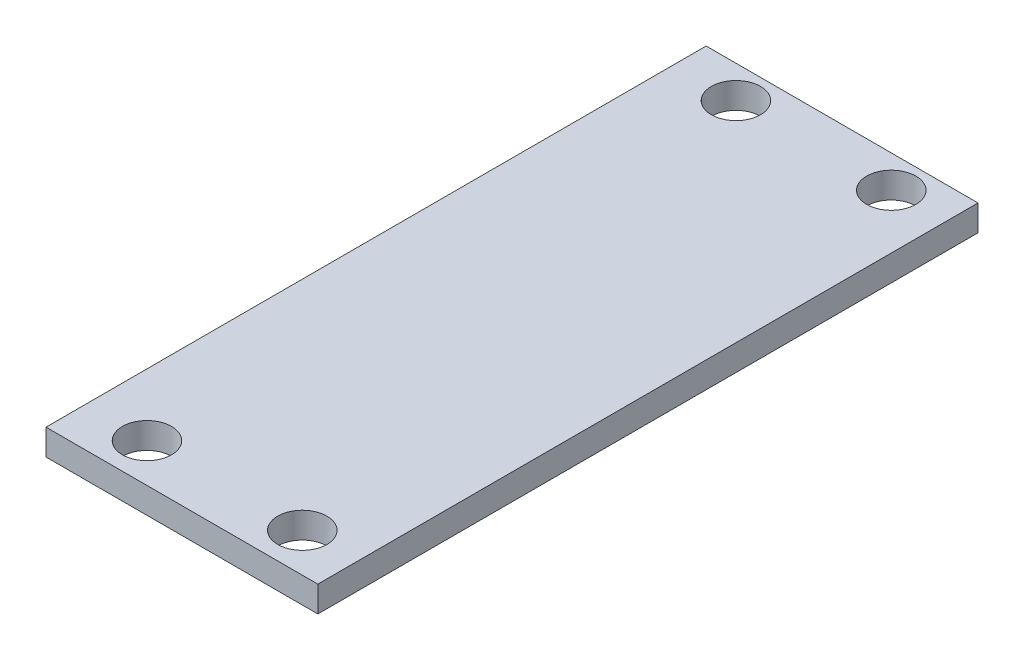
ISO-10303-21;
HEADER;
FILE_DESCRIPTION(('STEP AP214'),'2;1');
FILE_NAME('part.step','',(''),(''),'','','');
FILE_SCHEMA(('AUTOMOTIVE_DESIGN { 1 0 10303 214 1 1 1 1 }'));
ENDSEC;
DATA;
#1=APPLICATION_CONTEXT('core data for automotive mechanical design processes');
#2=APPLICATION_PROTOCOL_DEFINITION('international standard','automotive_design',2000,#1);
#3=PRODUCT_CONTEXT('',#1,'mechanical');
#4=PRODUCT('Part','Part','',(#3));
#5=PRODUCT_RELATED_PRODUCT_CATEGORY('part','',(#4));
#6=PRODUCT_DEFINITION_FORMATION('','',#4);
#7=PRODUCT_DEFINITION_CONTEXT('part definition',#1,'design');
#8=PRODUCT_DEFINITION('design','',#6,#7);
#9=PRODUCT_DEFINITION_SHAPE('','',#8);
#10=(LENGTH_UNIT() NAMED_UNIT(*) SI_UNIT(.MILLI.,.METRE.));
#11=(NAMED_UNIT(*) PLANE_ANGLE_UNIT() SI_UNIT($,.RADIAN.));
#12=(NAMED_UNIT(*) SI_UNIT($,.STERADIAN.) SOLID_ANGLE_UNIT());
#13=UNCERTAINTY_MEASURE_WITH_UNIT(LENGTH_MEASURE(1.E-05),#10,'distance_accuracy_value','');
#14=(GEOMETRIC_REPRESENTATION_CONTEXT(3) GLOBAL_UNCERTAINTY_ASSIGNED_CONTEXT((#13)) GLOBAL_UNIT_ASSIGNED_CONTEXT((#10,
#11,#12)) REPRESENTATION_CONTEXT('',''));
#15=CARTESIAN_POINT('',(0.,0.,0.));
#16=DIRECTION('',(0.,0.,1.));
#17=DIRECTION('',(1.,0.,0.));
#18=AXIS2_PLACEMENT_3D('',#15,#16,#17);
#19=CARTESIAN_POINT('',(0.,2.,0.));
#20=DIRECTION('',(0.,1.,0.));
#21=DIRECTION('',(0.,0.,1.));
#22=AXIS2_PLACEMENT_3D('',#19,#20,#21);
#23=PLANE('',#22);
#24=CARTESIAN_POINT('',(2.35497925311251,2.,34.9813278008299));
#25=DIRECTION('',(0.,1.,0.));
#26=DIRECTION('',(0.,0.,1.));
#27=AXIS2_PLACEMENT_3D('',#24,#25,#26);
#28=CIRCLE('',#27,1.9);
#29=CARTESIAN_POINT('',(2.35497925311251,2.,36.8813278008299));
#30=VERTEX_POINT('',#29);
#31=EDGE_CURVE('E124',#30,#30,#28,.T.);
#32=ORIENTED_EDGE('',*,*,#31,.F.);
#33=EDGE_LOOP('',(#32));
#34=FACE_BOUND('',#33,.T.);
#35=CARTESIAN_POINT('',(-9.64502074688796,2.,-10.5186721991701));
#36=DIRECTION('',(0.,1.,0.));
#37=DIRECTION('',(0.,0.,1.));
#38=AXIS2_PLACEMENT_3D('',#35,#36,#37);
#39=CIRCLE('',#38,1.9);
#40=CARTESIAN_POINT('',(-9.64502074688796,2.,-8.61867219917012));
#41=VERTEX_POINT('',#40);
#42=EDGE_CURVE('E103',#41,#41,#39,.T.);
#43=ORIENTED_EDGE('',*,*,#42,.F.);
#44=EDGE_LOOP('',(#43));
#45=FACE_BOUND('',#44,.T.);
#46=DIRECTION('',(0.,0.,1.));
#47=VECTOR('',#46,1.);
#48=CARTESIAN_POINT('',(-14.445020746888,2.,-13.0186721991701));
#49=LINE('',#48,#47);
#50=CARTESIAN_POINT('',(-14.445020746888,2.,-13.0186721991701));
#51=VERTEX_POINT('',#50);
#52=CARTESIAN_POINT('',(-14.445020746888,2.,37.9813278008299));
#53=VERTEX_POINT('',#52);
#54=EDGE_CURVE('E88',#51,#53,#49,.T.);
#55=ORIENTED_EDGE('',*,*,#54,.T.);
#56=DIRECTION('',(1.,0.,0.));
#57=VECTOR('',#56,1.);
#58=CARTESIAN_POINT('',(-14.445020746888,2.,37.9813278008299));
#59=LINE('',#58,#57);
#60=CARTESIAN_POINT('',(6.55497925311204,2.,37.9813278008299));
#61=VERTEX_POINT('',#60);
#62=EDGE_CURVE('E83',#53,#61,#59,.T.);
#63=ORIENTED_EDGE('',*,*,#62,.T.);
#64=DIRECTION('',(0.,0.,-1.));
#65=VECTOR('',#64,1.);
#66=CARTESIAN_POINT('',(6.55497925311204,2.,-13.0186721991701));
#67=LINE('',#66,#65);
#68=CARTESIAN_POINT('',(6.55497925311204,2.,-13.0186721991701));
#69=VERTEX_POINT('',#68);
#70=EDGE_CURVE('E86',#61,#69,#67,.T.);
#71=ORIENTED_EDGE('',*,*,#70,.T.);
#72=DIRECTION('',(-1.,0.,0.));
#73=VECTOR('',#72,1.);
#74=CARTESIAN_POINT('',(-14.445020746888,2.,-13.0186721991701));
#75=LINE('',#74,#73);
#76=EDGE_CURVE('E53',#69,#51,#75,.T.);
#77=ORIENTED_EDGE('',*,*,#76,.T.);
#78=EDGE_LOOP('',(#55,#63,#71,#77));
#79=FACE_BOUND('',#78,.T.);
#80=CARTESIAN_POINT('',(2.35497925311204,2.,-10.5186721991701));
#81=DIRECTION('',(0.,1.,0.));
#82=DIRECTION('',(0.,0.,1.));
#83=AXIS2_PLACEMENT_3D('',#80,#81,#82);
#84=CIRCLE('',#83,1.9);
#85=CARTESIAN_POINT('',(2.35497925311204,2.,-8.61867219917012));
#86=VERTEX_POINT('',#85);
#87=EDGE_CURVE('E118',#86,#86,#84,.T.);
#88=ORIENTED_EDGE('',*,*,#87,.F.);
#89=EDGE_LOOP('',(#88));
#90=FACE_BOUND('',#89,.T.);
#91=CARTESIAN_POINT('',(-9.64502074688749,2.,34.9813278008299));
#92=DIRECTION('',(0.,1.,0.));
#93=DIRECTION('',(0.,0.,1.));
#94=AXIS2_PLACEMENT_3D('',#91,#92,#93);
#95=CIRCLE('',#94,1.9);
#96=CARTESIAN_POINT('',(-9.64502074688749,2.,36.8813278008299));
#97=VERTEX_POINT('',#96);
#98=EDGE_CURVE('E130',#97,#97,#95,.T.);
#99=ORIENTED_EDGE('',*,*,#98,.F.);
#100=EDGE_LOOP('',(#99));
#101=FACE_BOUND('',#100,.T.);
#102=ADVANCED_FACE('F36',(#34,#45,#79,#90,#101),#23,.T.);
#103=CARTESIAN_POINT('',(0.,0.,0.));
#104=DIRECTION('',(0.,1.,0.));
#105=DIRECTION('',(0.,0.,1.));
#106=AXIS2_PLACEMENT_3D('',#103,#104,#105);
#107=PLANE('',#106);
#108=DIRECTION('',(0.,0.,1.));
#109=VECTOR('',#108,1.);
#110=CARTESIAN_POINT('',(-14.445020746888,0.,-13.0186721991701));
#111=LINE('',#110,#109);
#112=CARTESIAN_POINT('',(-14.445020746888,0.,-13.0186721991701));
#113=VERTEX_POINT('',#112);
#114=CARTESIAN_POINT('',(-14.445020746888,0.,37.9813278008299));
#115=VERTEX_POINT('',#114);
#116=EDGE_CURVE('E100',#113,#115,#111,.T.);
#117=ORIENTED_EDGE('',*,*,#116,.F.);
#118=DIRECTION('',(-1.,0.,0.));
#119=VECTOR('',#118,1.);
#120=CARTESIAN_POINT('',(-14.445020746888,0.,-13.0186721991701));
#121=LINE('',#120,#119);
#122=CARTESIAN_POINT('',(6.55497925311204,0.,-13.0186721991701));
#123=VERTEX_POINT('',#122);
#124=EDGE_CURVE('E76',#123,#113,#121,.T.);
#125=ORIENTED_EDGE('',*,*,#124,.F.);
#126=DIRECTION('',(0.,0.,-1.));
#127=VECTOR('',#126,1.);
#128=CARTESIAN_POINT('',(6.55497925311204,0.,-13.0186721991701));
#129=LINE('',#128,#127);
#130=CARTESIAN_POINT('',(6.55497925311204,0.,37.9813278008299));
#131=VERTEX_POINT('',#130);
#132=EDGE_CURVE('E70',#131,#123,#129,.T.);
#133=ORIENTED_EDGE('',*,*,#132,.F.);
#134=DIRECTION('',(1.,0.,0.));
#135=VECTOR('',#134,1.);
#136=CARTESIAN_POINT('',(-14.445020746888,0.,37.9813278008299));
#137=LINE('',#136,#135);
#138=EDGE_CURVE('E92',#115,#131,#137,.T.);
#139=ORIENTED_EDGE('',*,*,#138,.F.);
#140=EDGE_LOOP('',(#117,#125,#133,#139));
#141=FACE_BOUND('',#140,.T.);
#142=CARTESIAN_POINT('',(-9.64502074688796,0.,-10.5186721991701));
#143=DIRECTION('',(0.,1.,0.));
#144=DIRECTION('',(0.,0.,1.));
#145=AXIS2_PLACEMENT_3D('',#142,#143,#144);
#146=CIRCLE('',#145,1.9);
#147=CARTESIAN_POINT('',(-9.64502074688796,0.,-8.61867219917012));
#148=VERTEX_POINT('',#147);
#149=EDGE_CURVE('E115',#148,#148,#146,.T.);
#150=ORIENTED_EDGE('',*,*,#149,.T.);
#151=EDGE_LOOP('',(#150));
#152=FACE_BOUND('',#151,.T.);
#153=CARTESIAN_POINT('',(2.35497925311204,0.,-10.5186721991701));
#154=DIRECTION('',(0.,1.,0.));
#155=DIRECTION('',(0.,0.,1.));
#156=AXIS2_PLACEMENT_3D('',#153,#154,#155);
#157=CIRCLE('',#156,1.9);
#158=CARTESIAN_POINT('',(2.35497925311204,0.,-8.61867219917012));
#159=VERTEX_POINT('',#158);
#160=EDGE_CURVE('E121',#159,#159,#157,.T.);
#161=ORIENTED_EDGE('',*,*,#160,.T.);
#162=EDGE_LOOP('',(#161));
#163=FACE_BOUND('',#162,.T.);
#164=CARTESIAN_POINT('',(2.35497925311251,0.,34.9813278008299));
#165=DIRECTION('',(0.,1.,0.));
#166=DIRECTION('',(0.,0.,1.));
#167=AXIS2_PLACEMENT_3D('',#164,#165,#166);
#168=CIRCLE('',#167,1.9);
#169=CARTESIAN_POINT('',(2.35497925311251,0.,36.8813278008299));
#170=VERTEX_POINT('',#169);
#171=EDGE_CURVE('E127',#170,#170,#168,.T.);
#172=ORIENTED_EDGE('',*,*,#171,.T.);
#173=EDGE_LOOP('',(#172));
#174=FACE_BOUND('',#173,.T.);
#175=CARTESIAN_POINT('',(-9.64502074688749,0.,34.9813278008299));
#176=DIRECTION('',(0.,1.,0.));
#177=DIRECTION('',(0.,0.,1.));
#178=AXIS2_PLACEMENT_3D('',#175,#176,#177);
#179=CIRCLE('',#178,1.9);
#180=CARTESIAN_POINT('',(-9.64502074688749,0.,36.8813278008299));
#181=VERTEX_POINT('',#180);
#182=EDGE_CURVE('E133',#181,#181,#179,.T.);
#183=ORIENTED_EDGE('',*,*,#182,.T.);
#184=EDGE_LOOP('',(#183));
#185=FACE_BOUND('',#184,.T.);
#186=ADVANCED_FACE('F111',(#141,#152,#163,#174,#185),#107,.F.);
#187=CARTESIAN_POINT('',(-14.445020746888,2.,-13.0186721991701));
#188=DIRECTION('',(1.,0.,0.));
#189=DIRECTION('',(0.,0.,-1.));
#190=AXIS2_PLACEMENT_3D('',#187,#188,#189);
#191=PLANE('',#190);
#192=ORIENTED_EDGE('',*,*,#116,.T.);
#193=DIRECTION('',(0.,-1.,0.));
#194=VECTOR('',#193,1.);
#195=CARTESIAN_POINT('',(-14.445020746888,2.,37.9813278008299));
#196=LINE('',#195,#194);
#197=EDGE_CURVE('E11',#53,#115,#196,.T.);
#198=ORIENTED_EDGE('',*,*,#197,.F.);
#199=ORIENTED_EDGE('',*,*,#54,.F.);
#200=DIRECTION('',(0.,-1.,0.));
#201=VECTOR('',#200,1.);
#202=CARTESIAN_POINT('',(-14.445020746888,2.,-13.0186721991701));
#203=LINE('',#202,#201);
#204=EDGE_CURVE('E96',#51,#113,#203,.T.);
#205=ORIENTED_EDGE('',*,*,#204,.T.);
#206=EDGE_LOOP('',(#192,#198,#199,#205));
#207=FACE_BOUND('',#206,.T.);
#208=ADVANCED_FACE('F38',(#207),#191,.F.);
#209=CARTESIAN_POINT('',(-14.445020746888,2.,37.9813278008299));
#210=DIRECTION('',(0.,0.,-1.));
#211=DIRECTION('',(-1.,0.,0.));
#212=AXIS2_PLACEMENT_3D('',#209,#210,#211);
#213=PLANE('',#212);
#214=ORIENTED_EDGE('',*,*,#138,.T.);
#215=DIRECTION('',(0.,-1.,0.));
#216=VECTOR('',#215,1.);
#217=CARTESIAN_POINT('',(6.55497925311204,2.,37.9813278008299));
#218=LINE('',#217,#216);
#219=EDGE_CURVE('E45',#61,#131,#218,.T.);
#220=ORIENTED_EDGE('',*,*,#219,.F.);
#221=ORIENTED_EDGE('',*,*,#62,.F.);
#222=ORIENTED_EDGE('',*,*,#197,.T.);
#223=EDGE_LOOP('',(#214,#220,#221,#222));
#224=FACE_BOUND('',#223,.T.);
#225=ADVANCED_FACE('F91',(#224),#213,.F.);
#226=CARTESIAN_POINT('',(6.55497925311204,2.,-13.0186721991701));
#227=DIRECTION('',(-1.,0.,0.));
#228=DIRECTION('',(0.,0.,1.));
#229=AXIS2_PLACEMENT_3D('',#226,#227,#228);
#230=PLANE('',#229);
#231=ORIENTED_EDGE('',*,*,#132,.T.);
#232=DIRECTION('',(0.,-1.,0.));
#233=VECTOR('',#232,1.);
#234=CARTESIAN_POINT('',(6.55497925311204,2.,-13.0186721991701));
#235=LINE('',#234,#233);
#236=EDGE_CURVE('E93',#69,#123,#235,.T.);
#237=ORIENTED_EDGE('',*,*,#236,.F.);
#238=ORIENTED_EDGE('',*,*,#70,.F.);
#239=ORIENTED_EDGE('',*,*,#219,.T.);
#240=EDGE_LOOP('',(#231,#237,#238,#239));
#241=FACE_BOUND('',#240,.T.);
#242=ADVANCED_FACE('F94',(#241),#230,.F.);
#243=CARTESIAN_POINT('',(-14.445020746888,2.,-13.0186721991701));
#244=DIRECTION('',(0.,0.,1.));
#245=DIRECTION('',(1.,0.,0.));
#246=AXIS2_PLACEMENT_3D('',#243,#244,#245);
#247=PLANE('',#246);
#248=ORIENTED_EDGE('',*,*,#124,.T.);
#249=ORIENTED_EDGE('',*,*,#204,.F.);
#250=ORIENTED_EDGE('',*,*,#76,.F.);
#251=ORIENTED_EDGE('',*,*,#236,.T.);
#252=EDGE_LOOP('',(#248,#249,#250,#251));
#253=FACE_BOUND('',#252,.T.);
#254=ADVANCED_FACE('F108',(#253),#247,.F.);
#255=CARTESIAN_POINT('',(-9.64502074688796,2.,-10.5186721991701));
#256=DIRECTION('',(0.,-1.,0.));
#257=DIRECTION('',(0.,0.,-1.));
#258=AXIS2_PLACEMENT_3D('',#255,#256,#257);
#259=CYLINDRICAL_SURFACE('',#258,1.9);
#260=ORIENTED_EDGE('',*,*,#42,.T.);
#261=EDGE_LOOP('',(#260));
#262=FACE_BOUND('',#261,.T.);
#263=ORIENTED_EDGE('',*,*,#149,.F.);
#264=EDGE_LOOP('',(#263));
#265=FACE_BOUND('',#264,.T.);
#266=ADVANCED_FACE('F152',(#262,#265),#259,.F.);
#267=CARTESIAN_POINT('',(2.35497925311204,2.,-10.5186721991701));
#268=DIRECTION('',(0.,-1.,0.));
#269=DIRECTION('',(0.,0.,-1.));
#270=AXIS2_PLACEMENT_3D('',#267,#268,#269);
#271=CYLINDRICAL_SURFACE('',#270,1.9);
#272=ORIENTED_EDGE('',*,*,#87,.T.);
#273=EDGE_LOOP('',(#272));
#274=FACE_BOUND('',#273,.T.);
#275=ORIENTED_EDGE('',*,*,#160,.F.);
#276=EDGE_LOOP('',(#275));
#277=FACE_BOUND('',#276,.T.);
#278=ADVANCED_FACE('F198',(#274,#277),#271,.F.);
#279=CARTESIAN_POINT('',(2.35497925311251,2.,34.9813278008299));
#280=DIRECTION('',(0.,-1.,0.));
#281=DIRECTION('',(0.,0.,-1.));
#282=AXIS2_PLACEMENT_3D('',#279,#280,#281);
#283=CYLINDRICAL_SURFACE('',#282,1.9);
#284=ORIENTED_EDGE('',*,*,#31,.T.);
#285=EDGE_LOOP('',(#284));
#286=FACE_BOUND('',#285,.T.);
#287=ORIENTED_EDGE('',*,*,#171,.F.);
#288=EDGE_LOOP('',(#287));
#289=FACE_BOUND('',#288,.T.);
#290=ADVANCED_FACE('F206',(#286,#289),#283,.F.);
#291=CARTESIAN_POINT('',(-9.64502074688749,2.,34.9813278008299));
#292=DIRECTION('',(0.,-1.,0.));
#293=DIRECTION('',(0.,0.,-1.));
#294=AXIS2_PLACEMENT_3D('',#291,#292,#293);
#295=CYLINDRICAL_SURFACE('',#294,1.9);
#296=ORIENTED_EDGE('',*,*,#98,.T.);
#297=EDGE_LOOP('',(#296));
#298=FACE_BOUND('',#297,.T.);
#299=ORIENTED_EDGE('',*,*,#182,.F.);
#300=EDGE_LOOP('',(#299));
#301=FACE_BOUND('',#300,.T.);
#302=ADVANCED_FACE('F139',(#298,#301),#295,.F.);
#303=CLOSED_SHELL('',(#102,#186,#208,#225,#242,#254,#266,#278,#290,#302));
#304=MANIFOLD_SOLID_BREP('B2',#303);
#305=ADVANCED_BREP_SHAPE_REPRESENTATION('',(#18,#304),#14);
#306=SHAPE_DEFINITION_REPRESENTATION(#9,#305);
ENDSEC;
END-ISO-10303-21;
